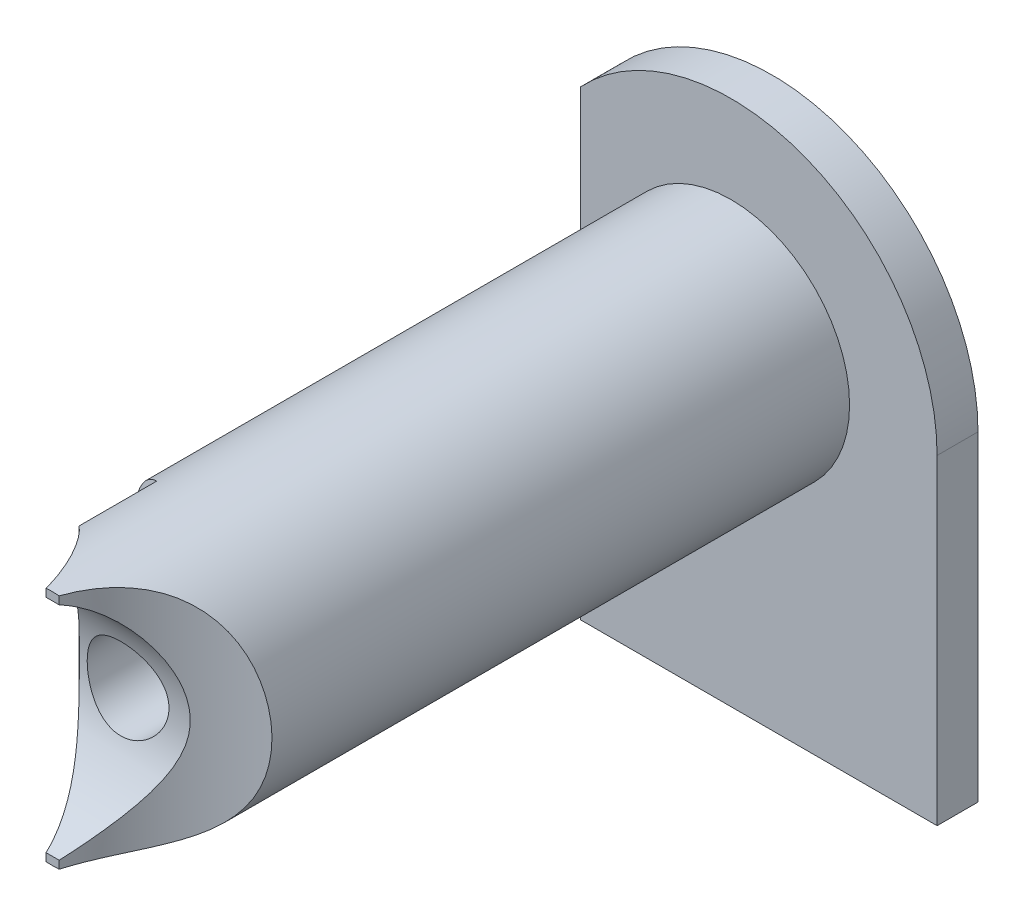
ISO-10303-21;
HEADER;
FILE_DESCRIPTION(('STEP AP214'),'2;1');
FILE_NAME('part.step','',(''),(''),'','','');
FILE_SCHEMA(('AUTOMOTIVE_DESIGN { 1 0 10303 214 1 1 1 1 }'));
ENDSEC;
DATA;
#1=APPLICATION_CONTEXT('core data for automotive mechanical design processes');
#2=APPLICATION_PROTOCOL_DEFINITION('international standard','automotive_design',2000,#1);
#3=PRODUCT_CONTEXT('',#1,'mechanical');
#4=PRODUCT('Part','Part','',(#3));
#5=PRODUCT_RELATED_PRODUCT_CATEGORY('part','',(#4));
#6=PRODUCT_DEFINITION_FORMATION('','',#4);
#7=PRODUCT_DEFINITION_CONTEXT('part definition',#1,'design');
#8=PRODUCT_DEFINITION('design','',#6,#7);
#9=PRODUCT_DEFINITION_SHAPE('','',#8);
#10=(LENGTH_UNIT() NAMED_UNIT(*) SI_UNIT(.MILLI.,.METRE.));
#11=(NAMED_UNIT(*) PLANE_ANGLE_UNIT() SI_UNIT($,.RADIAN.));
#12=(NAMED_UNIT(*) SI_UNIT($,.STERADIAN.) SOLID_ANGLE_UNIT());
#13=UNCERTAINTY_MEASURE_WITH_UNIT(LENGTH_MEASURE(1.E-05),#10,'distance_accuracy_value','');
#14=(GEOMETRIC_REPRESENTATION_CONTEXT(3) GLOBAL_UNCERTAINTY_ASSIGNED_CONTEXT((#13)) GLOBAL_UNIT_ASSIGNED_CONTEXT((#10,
#11,#12)) REPRESENTATION_CONTEXT('',''));
#15=CARTESIAN_POINT('',(0.,0.,0.));
#16=DIRECTION('',(0.,0.,1.));
#17=DIRECTION('',(1.,0.,0.));
#18=AXIS2_PLACEMENT_3D('',#15,#16,#17);
#19=CARTESIAN_POINT('',(0.,0.,0.));
#20=DIRECTION('',(0.,0.,1.));
#21=DIRECTION('',(1.,0.,0.));
#22=AXIS2_PLACEMENT_3D('',#19,#20,#21);
#23=CYLINDRICAL_SURFACE('',#22,2.2);
#24=CARTESIAN_POINT('',(0.,0.,1.39999999998963));
#25=DIRECTION('',(0.,0.,-1.));
#26=DIRECTION('',(1.,0.,0.));
#27=AXIS2_PLACEMENT_3D('',#24,#25,#26);
#28=CIRCLE('',#27,2.20000000001619);
#29=CARTESIAN_POINT('',(2.20000000001619,0.,1.39999999998963));
#30=VERTEX_POINT('',#29);
#31=EDGE_CURVE('E156',#30,#30,#28,.T.);
#32=ORIENTED_EDGE('',*,*,#31,.T.);
#33=EDGE_LOOP('',(#32));
#34=FACE_BOUND('',#33,.T.);
#35=CARTESIAN_POINT('',(0.,0.,16.));
#36=DIRECTION('',(0.,0.,1.));
#37=DIRECTION('',(1.,0.,0.));
#38=AXIS2_PLACEMENT_3D('',#35,#36,#37);
#39=CIRCLE('',#38,2.2);
#40=CARTESIAN_POINT('',(2.2,0.,16.));
#41=VERTEX_POINT('',#40);
#42=EDGE_CURVE('E19',#41,#41,#39,.T.);
#43=ORIENTED_EDGE('',*,*,#42,.T.);
#44=EDGE_LOOP('',(#43));
#45=FACE_BOUND('',#44,.T.);
#46=ADVANCED_FACE('F16',(#34,#45),#23,.F.);
#47=CARTESIAN_POINT('',(0.,0.,16.));
#48=DIRECTION('',(0.,0.,1.));
#49=DIRECTION('',(1.,0.,0.));
#50=AXIS2_PLACEMENT_3D('',#47,#48,#49);
#51=PLANE('',#50);
#52=CARTESIAN_POINT('',(0.,0.,16.));
#53=DIRECTION('',(0.,0.,-1.));
#54=DIRECTION('',(-1.,0.,0.));
#55=AXIS2_PLACEMENT_3D('',#52,#53,#54);
#56=CIRCLE('',#55,1.25);
#57=CARTESIAN_POINT('',(-1.25,0.,16.));
#58=VERTEX_POINT('',#57);
#59=EDGE_CURVE('E159',#58,#58,#56,.F.);
#60=ORIENTED_EDGE('',*,*,#59,.T.);
#61=EDGE_LOOP('',(#60));
#62=FACE_BOUND('',#61,.T.);
#63=ORIENTED_EDGE('',*,*,#42,.F.);
#64=EDGE_LOOP('',(#63));
#65=FACE_BOUND('',#64,.T.);
#66=ADVANCED_FACE('F246',(#62,#65),#51,.F.);
#67=CARTESIAN_POINT('',(0.,0.,0.));
#68=DIRECTION('',(0.,0.,-1.));
#69=DIRECTION('',(-1.,0.,0.));
#70=AXIS2_PLACEMENT_3D('',#67,#68,#69);
#71=CONICAL_SURFACE('',#70,3.60000000000582,0.785398163397448);
#72=CARTESIAN_POINT('',(0.,0.,0.));
#73=DIRECTION('',(0.,0.,-1.));
#74=DIRECTION('',(-1.,0.,0.));
#75=AXIS2_PLACEMENT_3D('',#72,#73,#74);
#76=CIRCLE('',#75,3.60000000000582);
#77=CARTESIAN_POINT('',(-3.60000000000582,0.,0.));
#78=VERTEX_POINT('',#77);
#79=EDGE_CURVE('E141',#78,#78,#76,.T.);
#80=ORIENTED_EDGE('',*,*,#79,.T.);
#81=EDGE_LOOP('',(#80));
#82=FACE_BOUND('',#81,.T.);
#83=ORIENTED_EDGE('',*,*,#31,.F.);
#84=EDGE_LOOP('',(#83));
#85=FACE_BOUND('',#84,.T.);
#86=ADVANCED_FACE('F243',(#82,#85),#71,.F.);
#87=CARTESIAN_POINT('',(0.,0.,22.));
#88=DIRECTION('',(0.,0.,-1.));
#89=DIRECTION('',(-1.,0.,0.));
#90=AXIS2_PLACEMENT_3D('',#87,#88,#89);
#91=CYLINDRICAL_SURFACE('',#90,1.25);
#92=ORIENTED_EDGE('',*,*,#59,.F.);
#93=EDGE_LOOP('',(#92));
#94=FACE_BOUND('',#93,.T.);
#95=CARTESIAN_POINT('',(0.,1.25,19.8978436713564));
#96=CARTESIAN_POINT('',(-0.0679244800988479,1.25000086796655,19.8978443860581));
#97=CARTESIAN_POINT('',(-0.135842933793422,1.24444487050265,19.8957833530326));
#98=CARTESIAN_POINT('',(-0.269657575517761,1.22244980443124,19.8878088146394));
#99=CARTESIAN_POINT('',(-0.335553550477822,1.20600959325332,19.881894904817));
#100=CARTESIAN_POINT('',(-0.463360945324166,1.16290062835713,19.8669627047752));
#101=CARTESIAN_POINT('',(-0.525280337329512,1.13625313605356,19.8579508713991));
#102=CARTESIAN_POINT('',(-0.643791152118634,1.07355949262704,19.837847899369));
#103=CARTESIAN_POINT('',(-0.700381263501824,1.03751103634852,19.8267562509232));
#104=CARTESIAN_POINT('',(-0.809007347203373,0.955414579593332,19.8032203151329));
#105=CARTESIAN_POINT('',(-0.860786737513333,0.909037171034703,19.7907405403483));
#106=CARTESIAN_POINT('',(-0.956009639956803,0.808301154152748,19.766133329688));
#107=CARTESIAN_POINT('',(-0.999451698829062,0.753941157312231,19.7540059555505));
#108=CARTESIAN_POINT('',(-1.07795080960379,0.636886846726681,19.7310560526318));
#109=CARTESIAN_POINT('',(-1.11273621101807,0.574000420441734,19.7202800833318));
#110=CARTESIAN_POINT('',(-1.17113157115788,0.442831894091509,19.701667612356));
#111=CARTESIAN_POINT('',(-1.19474477999888,0.374551369983123,19.6938302559428));
#112=CARTESIAN_POINT('',(-1.2292470985948,0.237225190263073,19.6822295733358));
#113=CARTESIAN_POINT('',(-1.24057636261075,0.16830221771519,19.678325699712));
#114=CARTESIAN_POINT('',(-1.25159174102537,0.0294302907076386,19.6745314082797));
#115=CARTESIAN_POINT('',(-1.25128107389356,-0.0405183747982762,19.6746398810475));
#116=CARTESIAN_POINT('',(-1.23929822635911,-0.176329706572923,19.6787644389511));
#117=CARTESIAN_POINT('',(-1.22810474950267,-0.242240442098288,19.6826158787156));
#118=CARTESIAN_POINT('',(-1.19546944676986,-0.371182833738493,19.6935843230476));
#119=CARTESIAN_POINT('',(-1.17402691447761,-0.434214291071031,19.7007015527082));
#120=CARTESIAN_POINT('',(-1.12123918718876,-0.556620898055839,19.7176047832685));
#121=CARTESIAN_POINT('',(-1.08976314845211,-0.61593458665218,19.7274257985207));
#122=CARTESIAN_POINT('',(-1.01791174395466,-0.728575193755699,19.7487221659081));
#123=CARTESIAN_POINT('',(-0.977533779711246,-0.781900357331002,19.760198000748));
#124=CARTESIAN_POINT('',(-0.886641267506775,-0.883891513879295,19.7842833845292));
#125=CARTESIAN_POINT('',(-0.8357188282652,-0.932187934326669,19.7969209237661));
#126=CARTESIAN_POINT('',(-0.726397770707999,-1.01968084494647,19.8214254442492));
#127=CARTESIAN_POINT('',(-0.66799781853852,-1.05887570804644,19.8332922874464));
#128=CARTESIAN_POINT('',(-0.544129319151011,-1.12761669610327,19.8550717885169));
#129=CARTESIAN_POINT('',(-0.478561028872439,-1.15699504567843,19.8649494215703));
#130=CARTESIAN_POINT('',(-0.342979508718129,-1.20416381175255,19.8812278361306));
#131=CARTESIAN_POINT('',(-0.272968324636218,-1.22195951975829,19.8876302050829));
#132=CARTESIAN_POINT('',(-0.134090244649073,-1.24468095728118,19.8958697798906));
#133=CARTESIAN_POINT('',(-0.065329920620134,-1.25018382842495,19.897911498419));
#134=CARTESIAN_POINT('',(0.0721472888909036,-1.24980687642328,19.8977724226291));
#135=CARTESIAN_POINT('',(0.140864180299875,-1.24392932217262,19.8955924699776));
#136=CARTESIAN_POINT('',(0.273588572060938,-1.22147843143933,19.8874606833778));
#137=CARTESIAN_POINT('',(0.337675880725648,-1.20531827758905,19.8816547123743));
#138=CARTESIAN_POINT('',(0.462212228709352,-1.16326336828004,19.8670890804522));
#139=CARTESIAN_POINT('',(0.522660591188891,-1.13736680831216,19.8583288720372));
#140=CARTESIAN_POINT('',(0.640446216933245,-1.07559215860392,19.838479568612));
#141=CARTESIAN_POINT('',(0.69761176173089,-1.03940914354079,19.8273223701759));
#142=CARTESIAN_POINT('',(0.80526753647923,-0.958428141299509,19.8040632405038));
#143=CARTESIAN_POINT('',(0.855755651824465,-0.913627436046384,19.7919610119165));
#144=CARTESIAN_POINT('',(0.951354636496911,-0.813903923966883,19.7674102209685));
#145=CARTESIAN_POINT('',(0.996046346298425,-0.758574360910484,19.7549766337844));
#146=CARTESIAN_POINT('',(1.07554433194323,-0.640894131740424,19.7317831377029));
#147=CARTESIAN_POINT('',(1.11035087446422,-0.578543655097271,19.7210231836585));
#148=CARTESIAN_POINT('',(1.16878954928363,-0.448840953661153,19.7024299594336));
#149=CARTESIAN_POINT('',(1.19248711414304,-0.381520791166974,19.6945796103623));
#150=CARTESIAN_POINT('',(1.22811609579468,-0.243523290194956,19.6826186057761));
#151=CARTESIAN_POINT('',(1.24005211170052,-0.172847275295524,19.6785064885507));
#152=CARTESIAN_POINT('',(1.25138151325684,-0.0339646408415084,19.6746036325415));
#153=CARTESIAN_POINT('',(1.25137467368776,0.0341877486817581,19.674606249536));
#154=CARTESIAN_POINT('',(1.24031579157669,0.169475270760439,19.6784153912838));
#155=CARTESIAN_POINT('',(1.22926475952144,0.236610495810688,19.6822215680309));
#156=CARTESIAN_POINT('',(1.19683703997043,0.366739710113705,19.6931287184379));
#157=CARTESIAN_POINT('',(1.17565097385536,0.429786678559307,19.7001687752202));
#158=CARTESIAN_POINT('',(1.12373438064327,0.551450801547351,19.7168175975318));
#159=CARTESIAN_POINT('',(1.09300209006457,0.610067135125508,19.7264268376227));
#160=CARTESIAN_POINT('',(1.02150459005946,0.72367495976101,19.7476932825457));
#161=CARTESIAN_POINT('',(0.980398025175527,0.7784393292172,19.7594152000636));
#162=CARTESIAN_POINT('',(0.889887080709123,0.880486113485907,19.7834460652259));
#163=CARTESIAN_POINT('',(0.840479956379136,0.92776604334017,19.7957552060804));
#164=CARTESIAN_POINT('',(0.732239723477382,1.01557160693506,19.8202070041386));
#165=CARTESIAN_POINT('',(0.673093154621859,1.05572043580642,19.8323198618095));
#166=CARTESIAN_POINT('',(0.548510903251562,1.1254910455994,19.8543727114239));
#167=CARTESIAN_POINT('',(0.483076273882375,1.15511458544152,19.8643130663155));
#168=CARTESIAN_POINT('',(0.349091955921276,1.20232010017759,19.8805798993618));
#169=CARTESIAN_POINT('',(0.280634096711385,1.22013735783424,19.8869765451443));
#170=CARTESIAN_POINT('',(0.141448006087147,1.24397438925929,19.8956071887561));
#171=CARTESIAN_POINT('',(0.0707207366450371,1.24999909630175,19.8978429272324));
#172=CARTESIAN_POINT('',(0.,1.25,19.8978436713564));
#173=B_SPLINE_CURVE_WITH_KNOTS('',3,(#95,#96,#97,#98,#99,#100,#101,#102,#103,#104,#105,#106,
#107,#108,#109,#110,#111,#112,#113,#114,#115,#116,#117,#118,#119,#120,#121,#122,#123,#124,#125,
#126,#127,#128,#129,#130,#131,#132,#133,#134,#135,#136,#137,#138,#139,#140,#141,#142,#143,#144,
#145,#146,#147,#148,#149,#150,#151,#152,#153,#154,#155,#156,#157,#158,#159,#160,#161,#162,#163,
#164,#165,#166,#167,#168,#169,#170,#171,#172),.UNSPECIFIED.,.T.,.F.,(4,2,2,2,2,2,2,2,2,2,2,2,2,
2,2,2,2,2,2,2,2,2,2,2,2,2,2,2,2,2,2,2,2,2,2,2,2,2,4),(0.,0.203511139491736,0.407043645954993,
0.610154486559866,0.813315177694251,1.02423741599598,1.23519638634716,1.45211698254992,
1.66897443527126,1.87777478156237,2.08651739447182,2.28647500077357,2.48644639113581,
2.68914025789089,2.89189336974925,3.1048510057456,3.31784668261728,3.53431589010938,
3.75068613453101,3.95666316344897,4.16259913132811,4.36074177300059,4.55892115580724,
4.7637300924964,4.96860373347955,5.18418899640245,5.3997684428082,5.61406164396909,
5.8282710168564,6.03172303865505,6.23515644734529,6.43490568970265,6.63469185386391,
6.84218649561138,7.04974988518443,7.26621834146235,7.4826506058514,7.69462841418539,
7.90651752514187),.UNSPECIFIED.);
#174=CARTESIAN_POINT('',(0.,1.25,19.8978436713564));
#175=VERTEX_POINT('',#174);
#176=EDGE_CURVE('E140',#175,#175,#173,.T.);
#177=ORIENTED_EDGE('',*,*,#176,.T.);
#178=EDGE_LOOP('',(#177));
#179=FACE_BOUND('',#178,.T.);
#180=ADVANCED_FACE('F239',(#94,#179),#91,.F.);
#181=CARTESIAN_POINT('',(0.,0.,0.));
#182=DIRECTION('',(0.,0.,1.));
#183=DIRECTION('',(1.,0.,0.));
#184=AXIS2_PLACEMENT_3D('',#181,#182,#183);
#185=PLANE('',#184);
#186=ORIENTED_EDGE('',*,*,#79,.F.);
#187=EDGE_LOOP('',(#186));
#188=FACE_BOUND('',#187,.T.);
#189=DIRECTION('',(0.,1.,0.));
#190=VECTOR('',#189,1.);
#191=CARTESIAN_POINT('',(6.3,-9.8,0.));
#192=LINE('',#191,#190);
#193=CARTESIAN_POINT('',(6.3,-9.8,0.));
#194=VERTEX_POINT('',#193);
#195=CARTESIAN_POINT('',(6.3,0.,0.));
#196=VERTEX_POINT('',#195);
#197=EDGE_CURVE('E90',#194,#196,#192,.T.);
#198=ORIENTED_EDGE('',*,*,#197,.F.);
#199=DIRECTION('',(1.,0.,0.));
#200=VECTOR('',#199,1.);
#201=CARTESIAN_POINT('',(-4.6,-9.8,0.));
#202=LINE('',#201,#200);
#203=CARTESIAN_POINT('',(-4.6,-9.8,0.));
#204=VERTEX_POINT('',#203);
#205=EDGE_CURVE('E106',#204,#194,#202,.T.);
#206=ORIENTED_EDGE('',*,*,#205,.F.);
#207=DIRECTION('',(0.,-1.,0.));
#208=VECTOR('',#207,1.);
#209=CARTESIAN_POINT('',(-4.6,4.30464865000618,0.));
#210=LINE('',#209,#208);
#211=CARTESIAN_POINT('',(-4.6,4.30464865000618,0.));
#212=VERTEX_POINT('',#211);
#213=EDGE_CURVE('E137',#212,#204,#210,.T.);
#214=ORIENTED_EDGE('',*,*,#213,.F.);
#215=CARTESIAN_POINT('',(0.,0.,0.));
#216=DIRECTION('',(0.,0.,1.));
#217=DIRECTION('',(1.,0.,0.));
#218=AXIS2_PLACEMENT_3D('',#215,#216,#217);
#219=CIRCLE('',#218,6.3);
#220=EDGE_CURVE('E86',#196,#212,#219,.T.);
#221=ORIENTED_EDGE('',*,*,#220,.F.);
#222=EDGE_LOOP('',(#198,#206,#214,#221));
#223=FACE_BOUND('',#222,.T.);
#224=ADVANCED_FACE('F229',(#188,#223),#185,.F.);
#225=CARTESIAN_POINT('',(0.,0.,23.2935034352874));
#226=DIRECTION('',(1.,0.,0.));
#227=DIRECTION('',(0.,0.,-1.));
#228=AXIS2_PLACEMENT_3D('',#225,#226,#227);
#229=CYLINDRICAL_SURFACE('',#228,3.61842579478704);
#230=ORIENTED_EDGE('',*,*,#176,.F.);
#231=EDGE_LOOP('',(#230));
#232=FACE_BOUND('',#231,.T.);
#233=DIRECTION('',(1.,0.,0.));
#234=VECTOR('',#233,1.);
#235=CARTESIAN_POINT('',(0.,3.37932746197818,22.));
#236=LINE('',#235,#234);
#237=CARTESIAN_POINT('',(-0.184638075837882,3.37932746197818,22.));
#238=VERTEX_POINT('',#237);
#239=CARTESIAN_POINT('',(0.218219539958672,3.37932746197818,22.));
#240=VERTEX_POINT('',#239);
#241=EDGE_CURVE('E142',#238,#240,#236,.T.);
#242=ORIENTED_EDGE('',*,*,#241,.F.);
#243=CARTESIAN_POINT('',(-0.184638075837882,3.37932746197818,22.));
#244=CARTESIAN_POINT('',(-0.211156231165822,3.34149870850248,21.9011564537886));
#245=CARTESIAN_POINT('',(-0.240102435210036,3.29956334294519,21.804599611213));
#246=CARTESIAN_POINT('',(-0.302028706600854,3.2081121569774,21.6166244880252));
#247=CARTESIAN_POINT('',(-0.335004563774821,3.15860423496916,21.5252009874701));
#248=CARTESIAN_POINT('',(-0.404101696405193,3.05275051746999,21.3481697718626));
#249=CARTESIAN_POINT('',(-0.440211237197433,2.99642994547444,21.2625423295464));
#250=CARTESIAN_POINT('',(-0.514855657187254,2.877318330208,21.0970419071478));
#251=CARTESIAN_POINT('',(-0.553391169868868,2.81452559413697,21.0171704418753));
#252=CARTESIAN_POINT('',(-0.671071326812881,2.61764283811563,20.7871974398669));
#253=CARTESIAN_POINT('',(-0.752632892515098,2.47453761652903,20.6458931668224));
#254=CARTESIAN_POINT('',(-0.91514122800787,2.16661334121827,20.3884801926924));
#255=CARTESIAN_POINT('',(-0.996087029222736,2.00176549151058,20.2724054551357));
#256=CARTESIAN_POINT('',(-1.13854217466289,1.67541983500405,20.0815381400047));
#257=CARTESIAN_POINT('',(-1.2012012753984,1.51645563765253,20.0032924300049));
#258=CARTESIAN_POINT('',(-1.31272831562854,1.18472090812666,19.8698730102282));
#259=CARTESIAN_POINT('',(-1.36162706865452,1.0119823531467,19.8146476153272));
#260=CARTESIAN_POINT('',(-1.43108421837339,0.688496535683084,19.7380477448507));
#261=CARTESIAN_POINT('',(-1.45520583678599,0.539567696935899,19.7123090323962));
#262=CARTESIAN_POINT('',(-1.48590572805914,0.237910065879286,19.6797308912269));
#263=CARTESIAN_POINT('',(-1.49250140019073,0.0851851943634162,19.6728727181946));
#264=CARTESIAN_POINT('',(-1.48711347849168,-0.219638538059778,19.6785316728409));
#265=CARTESIAN_POINT('',(-1.47511992170577,-0.371737019438807,19.6910591903351));
#266=CARTESIAN_POINT('',(-1.43442357218647,-0.67100977546266,19.7346139908888));
#267=CARTESIAN_POINT('',(-1.4056997864648,-0.81817761737474,19.7656645176927));
#268=CARTESIAN_POINT('',(-1.32503908738958,-1.14628720981243,19.8560875352559));
#269=CARTESIAN_POINT('',(-1.26877988168136,-1.32459779253885,19.9210717458046));
#270=CARTESIAN_POINT('',(-1.14340801119706,-1.66541071910351,20.075649049543));
#271=CARTESIAN_POINT('',(-1.07426888421057,-1.82787944915997,20.1652929910027));
#272=CARTESIAN_POINT('',(-0.929036379858701,-2.13918185944321,20.3690728991352));
#273=CARTESIAN_POINT('',(-0.852820661460019,-2.28762171998165,20.4837192110942));
#274=CARTESIAN_POINT('',(-0.701382057343645,-2.5651243495847,20.7345935165106));
#275=CARTESIAN_POINT('',(-0.626157563676736,-2.69422331116887,20.8707801939833));
#276=CARTESIAN_POINT('',(-0.518621597069257,-2.87119991529148,21.0894426414053));
#277=CARTESIAN_POINT('',(-0.483831102446247,-2.92715907171335,21.1642913146299));
#278=CARTESIAN_POINT('',(-0.416464846072824,-3.03352434479586,21.3187815726451));
#279=CARTESIAN_POINT('',(-0.383888590896951,-3.08393170019425,21.3984220821068));
#280=CARTESIAN_POINT('',(-0.321456204380259,-3.17898141683488,21.5625759173482));
#281=CARTESIAN_POINT('',(-0.291611547947464,-3.2235997601302,21.6471075640776));
#282=CARTESIAN_POINT('',(-0.235373748885312,-3.30641251909317,21.82045054339));
#283=CARTESIAN_POINT('',(-0.208983543288508,-3.34460147618006,21.9092654309972));
#284=CARTESIAN_POINT('',(-0.184638075837881,-3.37932746197819,22.));
#285=B_SPLINE_CURVE_WITH_KNOTS('',3,(#243,#244,#245,#246,#247,#248,#249,#250,#251,#252,#253,
#254,#255,#256,#257,#258,#259,#260,#261,#262,#263,#264,#265,#266,#267,#268,#269,#270,#271,#272,
#273,#274,#275,#276,#277,#278,#279,#280,#281,#282,#283,#284),.UNSPECIFIED.,.F.,.F.,(4,2,2,2,2,2,
2,2,2,2,2,2,2,2,2,2,2,2,2,2,4),(0.,0.327108060363067,0.653877234984881,0.979471606352299,
1.3051513543538,1.95341331613028,2.60254262412977,3.16433156329025,3.72485229241627,
4.182013982662,4.63872164565754,5.09567416720481,5.55320130900164,6.14384287358508,
6.73571158795343,7.34103221298297,7.94520556295312,8.24412659479571,8.54298079460886,
8.84303774768608,9.14334817979042),.UNSPECIFIED.);
#286=CARTESIAN_POINT('',(-0.184638075837881,-3.37932746197818,22.));
#287=VERTEX_POINT('',#286);
#288=EDGE_CURVE('E145',#238,#287,#285,.T.);
#289=ORIENTED_EDGE('',*,*,#288,.T.);
#290=DIRECTION('',(1.,0.,0.));
#291=VECTOR('',#290,1.);
#292=CARTESIAN_POINT('',(0.,-3.37932746197818,22.));
#293=LINE('',#292,#291);
#294=CARTESIAN_POINT('',(0.218219539958672,-3.37932746197818,22.));
#295=VERTEX_POINT('',#294);
#296=EDGE_CURVE('E138',#295,#287,#293,.F.);
#297=ORIENTED_EDGE('',*,*,#296,.F.);
#298=CARTESIAN_POINT('',(0.218219539958672,-3.37932746197818,22.));
#299=CARTESIAN_POINT('',(0.249955595366505,-3.34129490718428,21.9006260992964));
#300=CARTESIAN_POINT('',(0.284622608844999,-3.29921371335805,21.8038249336452));
#301=CARTESIAN_POINT('',(0.358874569765495,-3.20773227207749,21.6158999905739));
#302=CARTESIAN_POINT('',(0.398452521957451,-3.15834241634905,21.5247684090622));
#303=CARTESIAN_POINT('',(0.481412109280792,-3.05324603464561,21.3489932261304));
#304=CARTESIAN_POINT('',(0.524767948097167,-2.99758168690944,21.2643120424699));
#305=CARTESIAN_POINT('',(0.614630027769926,-2.88026548643591,21.1009731962136));
#306=CARTESIAN_POINT('',(0.661137389969564,-2.81861149910588,21.0223176990502));
#307=CARTESIAN_POINT('',(0.803537182970882,-2.62617949665099,20.7964695843413));
#308=CARTESIAN_POINT('',(0.902861324595828,-2.4872440652626,20.6582654552818));
#309=CARTESIAN_POINT('',(1.10382943480736,-2.18967908156275,20.4062047350761));
#310=CARTESIAN_POINT('',(1.20547857075844,-2.03100128134004,20.2924097196792));
#311=CARTESIAN_POINT('',(1.38744824926844,-1.71969183503718,20.1054786092747));
#312=CARTESIAN_POINT('',(1.46868125810829,-1.56972223376261,20.0288042654267));
#313=CARTESIAN_POINT('',(1.61859507468528,-1.25534052987597,19.8955423392714));
#314=CARTESIAN_POINT('',(1.68730843145521,-1.09096757227611,19.8389022990206));
#315=CARTESIAN_POINT('',(1.78407116856308,-0.799205821324052,19.7622552275132));
#316=CARTESIAN_POINT('',(1.81813629235307,-0.675412440235208,19.7363604986931));
#317=CARTESIAN_POINT('',(1.8699638889713,-0.422557817866898,19.69757133253));
#318=CARTESIAN_POINT('',(1.88776080128269,-0.293508311929657,19.6846494262472));
#319=CARTESIAN_POINT('',(1.9039713158961,-0.0327035544222784,19.6728618199396));
#320=CARTESIAN_POINT('',(1.90226877130446,0.0990632387624701,19.6740803467978));
#321=CARTESIAN_POINT('',(1.87953775332483,0.360062829307596,19.6906537282976));
#322=CARTESIAN_POINT('',(1.85848336601226,0.489291991489006,19.7060275382334));
#323=CARTESIAN_POINT('',(1.79340159777166,0.773832864086648,19.7551384332685));
#324=CARTESIAN_POINT('',(1.74490124501591,0.927444496541583,19.7925446470255));
#325=CARTESIAN_POINT('',(1.63224816655548,1.22347710666229,19.8846461611147));
#326=CARTESIAN_POINT('',(1.56804631713182,1.3658610718166,19.9393958842611));
#327=CARTESIAN_POINT('',(1.44859049514985,1.60457570668872,20.0483690565294));
#328=CARTESIAN_POINT('',(1.39519091495397,1.70343437789258,20.0992111252219));
#329=CARTESIAN_POINT('',(1.28581693924228,1.89508020958081,20.209044778376));
#330=CARTESIAN_POINT('',(1.22984131203267,1.98786441320282,20.2680402888479));
#331=CARTESIAN_POINT('',(1.11706053040588,2.16741089926434,20.3939595772521));
#332=CARTESIAN_POINT('',(1.06025509651569,2.25417109349274,20.4608860829024));
#333=CARTESIAN_POINT('',(0.947277450181522,2.42150527115037,20.6025285263854));
#334=CARTESIAN_POINT('',(0.891105375481016,2.50207793023455,20.6772461237552));
#335=CARTESIAN_POINT('',(0.738883420718191,2.71528114483798,20.8939750580893));
#336=CARTESIAN_POINT('',(0.644761687038023,2.84126157853707,21.0441856505552));
#337=CARTESIAN_POINT('',(0.513224865558886,3.01244722593785,21.2865363692757));
#338=CARTESIAN_POINT('',(0.471037092150247,3.06648426251062,21.3700355919397));
#339=CARTESIAN_POINT('',(0.390589747786621,3.16818347863871,21.5426088703919));
#340=CARTESIAN_POINT('',(0.352327503413965,3.21585000351376,21.6316790647196));
#341=CARTESIAN_POINT('',(0.298874623312115,3.28162373663356,21.7682373781404));
#342=CARTESIAN_POINT('',(0.281872812231806,3.30240414888444,21.8137549004021));
#343=CARTESIAN_POINT('',(0.249100289691648,3.34220484205815,21.9059898113939));
#344=CARTESIAN_POINT('',(0.233329651090148,3.36122501882607,21.9527072709168));
#345=CARTESIAN_POINT('',(0.218219539958636,3.37932746197831,21.9999999999999));
#346=B_SPLINE_CURVE_WITH_KNOTS('',3,(#298,#299,#300,#301,#302,#303,#304,#305,#306,#307,#308,
#309,#310,#311,#312,#313,#314,#315,#316,#317,#318,#319,#320,#321,#322,#323,#324,#325,#326,#327,
#328,#329,#330,#331,#332,#333,#334,#335,#336,#337,#338,#339,#340,#341,#342,#343,#344,#345),
.UNSPECIFIED.,.F.,.F.,(4,2,2,2,2,2,2,2,2,2,2,2,2,2,2,2,2,2,2,2,2,2,2,4),(0.,0.332850360488146,
0.665231930102698,0.995499245862366,1.32588469737193,1.98240202844311,2.64055653949701,
3.20000818888788,3.75798392959356,4.14950264865803,4.54019059773311,4.93320685141966,
5.32675015852905,5.82013096474709,6.31507556536427,6.6846162396128,7.0543354775105,
7.42418224452947,7.79410795210199,8.44346251961739,8.76727141479949,9.09085830055256,
9.24934826830561,9.4078476080825),.UNSPECIFIED.);
#347=EDGE_CURVE('E218',#295,#240,#346,.T.);
#348=ORIENTED_EDGE('',*,*,#347,.T.);
#349=EDGE_LOOP('',(#242,#289,#297,#348));
#350=FACE_BOUND('',#349,.T.);
#351=ADVANCED_FACE('F223',(#232,#350),#229,.F.);
#352=CARTESIAN_POINT('',(0.,0.,0.));
#353=DIRECTION('',(0.,0.,1.));
#354=DIRECTION('',(1.,0.,0.));
#355=AXIS2_PLACEMENT_3D('',#352,#353,#354);
#356=CYLINDRICAL_SURFACE('',#355,6.3);
#357=CARTESIAN_POINT('',(0.,0.,1.25));
#358=DIRECTION('',(0.,0.,1.));
#359=DIRECTION('',(1.,0.,0.));
#360=AXIS2_PLACEMENT_3D('',#357,#358,#359);
#361=CIRCLE('',#360,6.3);
#362=CARTESIAN_POINT('',(6.3,0.,1.25));
#363=VERTEX_POINT('',#362);
#364=CARTESIAN_POINT('',(-4.6,4.30464865000618,1.25));
#365=VERTEX_POINT('',#364);
#366=EDGE_CURVE('E123',#363,#365,#361,.T.);
#367=ORIENTED_EDGE('',*,*,#366,.F.);
#368=DIRECTION('',(0.,0.,1.));
#369=VECTOR('',#368,1.);
#370=CARTESIAN_POINT('',(6.3,0.,0.));
#371=LINE('',#370,#369);
#372=EDGE_CURVE('E109',#196,#363,#371,.T.);
#373=ORIENTED_EDGE('',*,*,#372,.F.);
#374=ORIENTED_EDGE('',*,*,#220,.T.);
#375=DIRECTION('',(0.,0.,1.));
#376=VECTOR('',#375,1.);
#377=CARTESIAN_POINT('',(-4.6,4.30464865000618,0.));
#378=LINE('',#377,#376);
#379=EDGE_CURVE('E134',#365,#212,#378,.F.);
#380=ORIENTED_EDGE('',*,*,#379,.F.);
#381=EDGE_LOOP('',(#367,#373,#374,#380));
#382=FACE_BOUND('',#381,.T.);
#383=ADVANCED_FACE('F228',(#382),#356,.T.);
#384=CARTESIAN_POINT('',(-4.6,4.30464865000618,0.));
#385=DIRECTION('',(-1.,0.,0.));
#386=DIRECTION('',(0.,-1.,0.));
#387=AXIS2_PLACEMENT_3D('',#384,#385,#386);
#388=PLANE('',#387);
#389=DIRECTION('',(0.,1.,0.));
#390=VECTOR('',#389,1.);
#391=CARTESIAN_POINT('',(-4.6,-3.08264576191558,1.25));
#392=LINE('',#391,#390);
#393=CARTESIAN_POINT('',(-4.6,-9.8,1.25));
#394=VERTEX_POINT('',#393);
#395=EDGE_CURVE('E121',#365,#394,#392,.F.);
#396=ORIENTED_EDGE('',*,*,#395,.F.);
#397=ORIENTED_EDGE('',*,*,#379,.T.);
#398=ORIENTED_EDGE('',*,*,#213,.T.);
#399=DIRECTION('',(0.,0.,1.));
#400=VECTOR('',#399,1.);
#401=CARTESIAN_POINT('',(-4.6,-9.8,0.));
#402=LINE('',#401,#400);
#403=EDGE_CURVE('E130',#394,#204,#402,.F.);
#404=ORIENTED_EDGE('',*,*,#403,.F.);
#405=EDGE_LOOP('',(#396,#397,#398,#404));
#406=FACE_BOUND('',#405,.T.);
#407=ADVANCED_FACE('F282',(#406),#388,.T.);
#408=CARTESIAN_POINT('',(-4.6,-9.8,0.));
#409=DIRECTION('',(0.,-1.,0.));
#410=DIRECTION('',(1.,0.,0.));
#411=AXIS2_PLACEMENT_3D('',#408,#409,#410);
#412=PLANE('',#411);
#413=DIRECTION('',(1.,0.,0.));
#414=VECTOR('',#413,1.);
#415=CARTESIAN_POINT('',(0.574107153339075,-9.8,1.25));
#416=LINE('',#415,#414);
#417=CARTESIAN_POINT('',(6.3,-9.8,1.25));
#418=VERTEX_POINT('',#417);
#419=EDGE_CURVE('E104',#394,#418,#416,.T.);
#420=ORIENTED_EDGE('',*,*,#419,.F.);
#421=ORIENTED_EDGE('',*,*,#403,.T.);
#422=ORIENTED_EDGE('',*,*,#205,.T.);
#423=DIRECTION('',(0.,0.,1.));
#424=VECTOR('',#423,1.);
#425=CARTESIAN_POINT('',(6.3,-9.8,0.));
#426=LINE('',#425,#424);
#427=EDGE_CURVE('E99',#418,#194,#426,.F.);
#428=ORIENTED_EDGE('',*,*,#427,.F.);
#429=EDGE_LOOP('',(#420,#421,#422,#428));
#430=FACE_BOUND('',#429,.T.);
#431=ADVANCED_FACE('F101',(#430),#412,.T.);
#432=CARTESIAN_POINT('',(6.3,-9.8,0.));
#433=DIRECTION('',(1.,0.,0.));
#434=DIRECTION('',(0.,1.,0.));
#435=AXIS2_PLACEMENT_3D('',#432,#433,#434);
#436=PLANE('',#435);
#437=DIRECTION('',(0.,1.,0.));
#438=VECTOR('',#437,1.);
#439=CARTESIAN_POINT('',(6.3,-3.08264576191558,1.25));
#440=LINE('',#439,#438);
#441=EDGE_CURVE('E113',#418,#363,#440,.T.);
#442=ORIENTED_EDGE('',*,*,#441,.F.);
#443=ORIENTED_EDGE('',*,*,#427,.T.);
#444=ORIENTED_EDGE('',*,*,#197,.T.);
#445=ORIENTED_EDGE('',*,*,#372,.T.);
#446=EDGE_LOOP('',(#442,#443,#444,#445));
#447=FACE_BOUND('',#446,.T.);
#448=ADVANCED_FACE('F114',(#447),#436,.T.);
#449=CARTESIAN_POINT('',(-1.8,0.,17.));
#450=DIRECTION('',(0.5,0.,-0.866025403784439));
#451=DIRECTION('',(-0.866025403784439,0.,-0.5));
#452=AXIS2_PLACEMENT_3D('',#449,#450,#451);
#453=PLANE('',#452);
#454=DIRECTION('',(0.,1.,0.));
#455=VECTOR('',#454,1.);
#456=CARTESIAN_POINT('',(-1.8,0.,17.));
#457=LINE('',#456,#455);
#458=CARTESIAN_POINT('',(-1.8,-3.14652586196268,17.));
#459=VERTEX_POINT('',#458);
#460=CARTESIAN_POINT('',(-1.8,3.14652586196268,17.));
#461=VERTEX_POINT('',#460);
#462=EDGE_CURVE('E108',#459,#461,#457,.T.);
#463=ORIENTED_EDGE('',*,*,#462,.T.);
#464=CARTESIAN_POINT('',(0.,0.,18.0392304845413));
#465=DIRECTION('',(0.5,0.,-0.866025403784439));
#466=DIRECTION('',(0.866025403784439,0.,0.5));
#467=AXIS2_PLACEMENT_3D('',#464,#465,#466);
#468=ELLIPSE('',#467,4.18578945162479,3.625);
#469=EDGE_CURVE('E198',#459,#461,#468,.T.);
#470=ORIENTED_EDGE('',*,*,#469,.F.);
#471=EDGE_LOOP('',(#463,#470));
#472=FACE_BOUND('',#471,.T.);
#473=ADVANCED_FACE('F301',(#472),#453,.F.);
#474=CARTESIAN_POINT('',(-1.8,0.,22.));
#475=DIRECTION('',(1.,0.,0.));
#476=DIRECTION('',(0.,0.,-1.));
#477=AXIS2_PLACEMENT_3D('',#474,#475,#476);
#478=PLANE('',#477);
#479=DIRECTION('',(0.,0.,1.));
#480=VECTOR('',#479,1.);
#481=CARTESIAN_POINT('',(-1.8,3.14652586196268,0.));
#482=LINE('',#481,#480);
#483=CARTESIAN_POINT('',(-1.79999999999999,3.14652586196269,19.3750776405004));
#484=VERTEX_POINT('',#483);
#485=EDGE_CURVE('E424',#461,#484,#482,.T.);
#486=ORIENTED_EDGE('',*,*,#485,.F.);
#487=ORIENTED_EDGE('',*,*,#462,.F.);
#488=DIRECTION('',(0.,0.,1.));
#489=VECTOR('',#488,1.);
#490=CARTESIAN_POINT('',(-1.8,-3.14652586196268,0.));
#491=LINE('',#490,#489);
#492=CARTESIAN_POINT('',(-1.8,-3.14652586196268,19.3750776405004));
#493=VERTEX_POINT('',#492);
#494=EDGE_CURVE('E197',#493,#459,#491,.F.);
#495=ORIENTED_EDGE('',*,*,#494,.F.);
#496=DIRECTION('',(0.,1.,0.));
#497=VECTOR('',#496,1.);
#498=CARTESIAN_POINT('',(-1.79999999999999,0.,19.3750776405004));
#499=LINE('',#498,#497);
#500=EDGE_CURVE('E217',#493,#484,#499,.T.);
#501=ORIENTED_EDGE('',*,*,#500,.T.);
#502=EDGE_LOOP('',(#486,#487,#495,#501));
#503=FACE_BOUND('',#502,.T.);
#504=ADVANCED_FACE('F205',(#503),#478,.F.);
#505=CARTESIAN_POINT('',(-5.4,0.,23.4));
#506=DIRECTION('',(0.,1.,0.));
#507=DIRECTION('',(0.,0.,1.));
#508=AXIS2_PLACEMENT_3D('',#505,#506,#507);
#509=CYLINDRICAL_SURFACE('',#508,5.4);
#510=DIRECTION('',(0.,1.,0.));
#511=VECTOR('',#510,1.);
#512=CARTESIAN_POINT('',(-0.184638075837881,0.,22.));
#513=LINE('',#512,#511);
#514=CARTESIAN_POINT('',(-0.184638075837881,3.62029470912948,22.));
#515=VERTEX_POINT('',#514);
#516=EDGE_CURVE('E144',#515,#238,#513,.F.);
#517=ORIENTED_EDGE('',*,*,#516,.F.);
#518=CARTESIAN_POINT('',(-1.79999999999999,3.14652586196269,19.3750776405004));
#519=CARTESIAN_POINT('',(-1.71977721871926,3.19242463934373,19.4467729888297));
#520=CARTESIAN_POINT('',(-1.64036903943807,3.23377401589615,19.5221673969035));
#521=CARTESIAN_POINT('',(-1.48454971683947,3.30819685108098,19.6796006841654));
#522=CARTESIAN_POINT('',(-1.40813441050172,3.34128217650513,19.7616298093544));
#523=CARTESIAN_POINT('',(-1.25990098807927,3.39994080184454,19.931250397919));
#524=CARTESIAN_POINT('',(-1.18805680222206,3.42556038862744,20.0188033076942));
#525=CARTESIAN_POINT('',(-1.04931897795177,3.47057255990351,20.1992922210633));
#526=CARTESIAN_POINT('',(-0.98242688432158,3.48996320755339,20.2922298884256));
#527=CARTESIAN_POINT('',(-0.8546555516464,3.52342600211264,20.4823150131274));
#528=CARTESIAN_POINT('',(-0.793745926306146,3.53752617552029,20.5794371580583));
#529=CARTESIAN_POINT('',(-0.678022567689542,3.56151583691171,20.7777605312194));
#530=CARTESIAN_POINT('',(-0.623211483306292,3.57140350043168,20.8789635061526));
#531=CARTESIAN_POINT('',(-0.468513246336572,3.59612305268534,21.1879067885231));
#532=CARTESIAN_POINT('',(-0.378308769641544,3.60602353140226,21.4010591801451));
#533=CARTESIAN_POINT('',(-0.280230709335227,3.61421678180914,21.6817385059798));
#534=CARTESIAN_POINT('',(-0.259448652463061,3.61575619668838,21.7449543539739));
#535=CARTESIAN_POINT('',(-0.2202692021038,3.61835541177585,21.8720004816896));
#536=CARTESIAN_POINT('',(-0.201867397620007,3.61941610848206,21.9358293823759));
#537=CARTESIAN_POINT('',(-0.184638075837881,3.62029470912948,22.));
#538=B_SPLINE_CURVE_WITH_KNOTS('',3,(#518,#519,#520,#521,#522,#523,#524,#525,#526,#527,#528,
#529,#530,#531,#532,#533,#534,#535,#536,#537),.UNSPECIFIED.,.F.,.F.,(4,2,2,2,2,2,2,2,2,4),(0.,
0.350661379517194,0.700816292854721,1.04875169253755,1.39679517571378,1.74296794119285,
2.0892904841724,2.78165454430928,2.98131823544443,3.18060644789511),.UNSPECIFIED.);
#539=EDGE_CURVE('E185',#484,#515,#538,.T.);
#540=ORIENTED_EDGE('',*,*,#539,.F.);
#541=ORIENTED_EDGE('',*,*,#500,.F.);
#542=CARTESIAN_POINT('',(-0.184638075837882,-3.62029470912948,22.));
#543=CARTESIAN_POINT('',(-0.204983350822555,-3.61925358335016,21.9242092524802));
#544=CARTESIAN_POINT('',(-0.226977254859606,-3.61796378997867,21.8488753488475));
#545=CARTESIAN_POINT('',(-0.274223298941085,-3.61469118632956,21.6992436620036));
#546=CARTESIAN_POINT('',(-0.299475760381463,-3.61270830765899,21.6249459817985));
#547=CARTESIAN_POINT('',(-0.380114758235599,-3.60542149905208,21.4036518139308));
#548=CARTESIAN_POINT('',(-0.440338160992857,-3.59878081838098,21.2584208206065));
#549=CARTESIAN_POINT('',(-0.570751979422838,-3.58036972156668,20.9789842491485));
#550=CARTESIAN_POINT('',(-0.640524799019833,-3.56878499742176,20.8445710124984));
#551=CARTESIAN_POINT('',(-0.790699037878973,-3.53854209137756,20.582717078743));
#552=CARTESIAN_POINT('',(-0.871092795641695,-3.51988899035711,20.4552714483155));
#553=CARTESIAN_POINT('',(-1.01761791880794,-3.4798168050056,20.2430357914268));
#554=CARTESIAN_POINT('',(-1.0814836982068,-3.46061574664352,20.1562531375526));
#555=CARTESIAN_POINT('',(-1.2135103815742,-3.41655679626519,19.9875561876652));
#556=CARTESIAN_POINT('',(-1.28166963676559,-3.39170106629013,19.9056400460178));
#557=CARTESIAN_POINT('',(-1.42330098037786,-3.33478666391136,19.7451988220611));
#558=CARTESIAN_POINT('',(-1.49686391650205,-3.30256147194254,19.6668122145873));
#559=CARTESIAN_POINT('',(-1.64670082041077,-3.2304700446727,19.5161674103917));
#560=CARTESIAN_POINT('',(-1.72297851462402,-3.19059294832857,19.4439181377991));
#561=CARTESIAN_POINT('',(-1.79999999999999,-3.14652586196269,19.3750776405004));
#562=B_SPLINE_CURVE_WITH_KNOTS('',3,(#542,#543,#544,#545,#546,#547,#548,#549,#550,#551,#552,
#553,#554,#555,#556,#557,#558,#559,#560,#561),.UNSPECIFIED.,.F.,.F.,(4,2,2,2,2,2,2,2,2,4),(0.,
0.235401858579509,0.470826952936754,0.942192882603263,1.39722819939926,1.85193704703066,
2.17997757710563,2.50789289235904,2.84411522339552,3.1808183634309),.UNSPECIFIED.);
#563=CARTESIAN_POINT('',(-0.184638075837881,-3.62029470912948,22.));
#564=VERTEX_POINT('',#563);
#565=EDGE_CURVE('E117',#564,#493,#562,.T.);
#566=ORIENTED_EDGE('',*,*,#565,.F.);
#567=DIRECTION('',(0.,1.,0.));
#568=VECTOR('',#567,1.);
#569=CARTESIAN_POINT('',(-0.184638075837881,0.,22.));
#570=LINE('',#569,#568);
#571=EDGE_CURVE('E410',#287,#564,#570,.F.);
#572=ORIENTED_EDGE('',*,*,#571,.F.);
#573=ORIENTED_EDGE('',*,*,#288,.F.);
#574=EDGE_LOOP('',(#517,#540,#541,#566,#572,#573));
#575=FACE_BOUND('',#574,.T.);
#576=ADVANCED_FACE('F200',(#575),#509,.F.);
#577=CARTESIAN_POINT('',(0.,0.,22.));
#578=DIRECTION('',(0.,0.,1.));
#579=DIRECTION('',(1.,0.,0.));
#580=AXIS2_PLACEMENT_3D('',#577,#578,#579);
#581=PLANE('',#580);
#582=CARTESIAN_POINT('',(0.,0.,22.));
#583=DIRECTION('',(0.,0.,1.));
#584=DIRECTION('',(1.,0.,0.));
#585=AXIS2_PLACEMENT_3D('',#582,#583,#584);
#586=CIRCLE('',#585,3.625);
#587=CARTESIAN_POINT('',(0.218219539958671,3.61842579478704,22.));
#588=VERTEX_POINT('',#587);
#589=EDGE_CURVE('E172',#515,#588,#586,.F.);
#590=ORIENTED_EDGE('',*,*,#589,.F.);
#591=ORIENTED_EDGE('',*,*,#516,.T.);
#592=ORIENTED_EDGE('',*,*,#241,.T.);
#593=DIRECTION('',(0.,1.,0.));
#594=VECTOR('',#593,1.);
#595=CARTESIAN_POINT('',(0.218219539958671,0.,22.));
#596=LINE('',#595,#594);
#597=EDGE_CURVE('E407',#240,#588,#596,.T.);
#598=ORIENTED_EDGE('',*,*,#597,.T.);
#599=EDGE_LOOP('',(#590,#591,#592,#598));
#600=FACE_BOUND('',#599,.T.);
#601=ADVANCED_FACE('F204',(#600),#581,.T.);
#602=CARTESIAN_POINT('',(4.6,0.,23.4));
#603=DIRECTION('',(0.,1.,0.));
#604=DIRECTION('',(0.,0.,1.));
#605=AXIS2_PLACEMENT_3D('',#602,#603,#604);
#606=CYLINDRICAL_SURFACE('',#605,4.6);
#607=DIRECTION('',(0.,1.,0.));
#608=VECTOR('',#607,1.);
#609=CARTESIAN_POINT('',(0.218219539958671,0.,22.));
#610=LINE('',#609,#608);
#611=CARTESIAN_POINT('',(0.218219539958671,-3.61842579478704,22.));
#612=VERTEX_POINT('',#611);
#613=EDGE_CURVE('E34',#612,#295,#610,.T.);
#614=ORIENTED_EDGE('',*,*,#613,.F.);
#615=CARTESIAN_POINT('',(0.218219539958671,3.61842579478704,22.));
#616=CARTESIAN_POINT('',(0.253921932489337,3.61624568485412,21.8882086347392));
#617=CARTESIAN_POINT('',(0.293930942162563,3.61332855383558,21.7777891194954));
#618=CARTESIAN_POINT('',(0.382261584654122,3.60506903524106,21.5603174520332));
#619=CARTESIAN_POINT('',(0.430590013447029,3.5997246590009,21.4532681381064));
#620=CARTESIAN_POINT('',(0.535481817338599,3.58562189737931,21.2427792071954));
#621=CARTESIAN_POINT('',(0.592088281238027,3.57684521941974,21.1393622222685));
#622=CARTESIAN_POINT('',(0.712819588473588,3.5547545631105,20.937554011475));
#623=CARTESIAN_POINT('',(0.776941494796075,3.54144235338112,20.8391608437534));
#624=CARTESIAN_POINT('',(0.901260128819358,3.51166071600719,20.6633969000155));
#625=CARTESIAN_POINT('',(0.960455158990197,3.49603195599884,20.5851739985923));
#626=CARTESIAN_POINT('',(1.08312801054962,3.45999189620774,20.433329815249));
#627=CARTESIAN_POINT('',(1.14660500933964,3.4395815131584,20.3597076546972));
#628=CARTESIAN_POINT('',(1.27697973013087,3.39333419365901,20.2177368983382));
#629=CARTESIAN_POINT('',(1.34386762848448,3.36751224143441,20.1493744389007));
#630=CARTESIAN_POINT('',(1.48037213038412,3.30977536549797,20.01815382368));
#631=CARTESIAN_POINT('',(1.54998869992139,3.27786051770569,19.9552955993264));
#632=CARTESIAN_POINT('',(1.69148011581044,3.20715145188321,19.835003506886));
#633=CARTESIAN_POINT('',(1.76336821377863,3.16830620633323,19.7776150817769));
#634=CARTESIAN_POINT('',(1.90770650732564,3.0835503493824,19.6690873408845));
#635=CARTESIAN_POINT('',(1.98015670832778,3.0376396697317,19.6179480854749));
#636=CARTESIAN_POINT('',(2.12436529051996,2.93859653384595,19.5220190202424));
#637=CARTESIAN_POINT('',(2.1961234665108,2.88546200207908,19.4772310428301));
#638=CARTESIAN_POINT('',(2.33762727540595,2.77206433118164,19.3939532912806));
#639=CARTESIAN_POINT('',(2.40737309036462,2.71180183943494,19.3554629459282));
#640=CARTESIAN_POINT('',(2.5357590336438,2.59178742172974,19.2886095802698));
#641=CARTESIAN_POINT('',(2.59475298935761,2.53277628497101,19.2595907121756));
#642=CARTESIAN_POINT('',(2.70943534607864,2.409701444093,19.2059836041323));
#643=CARTESIAN_POINT('',(2.76512263730632,2.34563606028345,19.1813968461104));
#644=CARTESIAN_POINT('',(2.87245814008219,2.21289253768532,19.1363175372921));
#645=CARTESIAN_POINT('',(2.92410763623724,2.14421587898563,19.1158236811045));
#646=CARTESIAN_POINT('',(3.0228191888843,2.00265780346786,19.0785087142437));
#647=CARTESIAN_POINT('',(3.06987946142927,1.92977476891131,19.0616890286875));
#648=CARTESIAN_POINT('',(3.15948596449291,1.77933667384605,19.0311110405209));
#649=CARTESIAN_POINT('',(3.20196512081568,1.70173298256952,19.0173956457138));
#650=CARTESIAN_POINT('',(3.28129967433372,1.54322889664342,18.9928745615827));
#651=CARTESIAN_POINT('',(3.31815306279162,1.46232733745996,18.9820699105212));
#652=CARTESIAN_POINT('',(3.38589877994151,1.29777934352134,18.9629742554142));
#653=CARTESIAN_POINT('',(3.4167910216851,1.21413286875007,18.954683288032));
#654=CARTESIAN_POINT('',(3.47236962782216,1.04462022652277,18.9402607605764));
#655=CARTESIAN_POINT('',(3.49705566860204,0.958753943575327,18.9341293131015));
#656=CARTESIAN_POINT('',(3.54159374783891,0.779048127351706,18.9233561376554));
#657=CARTESIAN_POINT('',(3.56096683256059,0.685081195243556,18.9188542844025));
#658=CARTESIAN_POINT('',(3.59220305475898,0.495876282277335,18.9117261975752));
#659=CARTESIAN_POINT('',(3.60406899883835,0.400638790041195,18.909099263001));
#660=CARTESIAN_POINT('',(3.6202173259986,0.209432599195088,18.9055484631236));
#661=CARTESIAN_POINT('',(3.62449506502896,0.113463488881477,18.9046256407385));
#662=CARTESIAN_POINT('',(3.62542053513718,-0.0784807621807852,18.9044249747784));
#663=CARTESIAN_POINT('',(3.62207076278328,-0.174455890677439,18.90514659296));
#664=CARTESIAN_POINT('',(3.60751966139422,-0.369174122666772,18.9083364940046));
#665=CARTESIAN_POINT('',(3.59604674838699,-0.467896076527943,18.9108652227649));
#666=CARTESIAN_POINT('',(3.56505643055074,-0.663961362296133,18.9179085648042));
#667=CARTESIAN_POINT('',(3.54554191031585,-0.761305175616237,18.9224224660237));
#668=CARTESIAN_POINT('',(3.49862211782569,-0.953994549740079,18.9337320934756));
#669=CARTESIAN_POINT('',(3.47121264110125,-1.04933901668782,18.9405290358657));
#670=CARTESIAN_POINT('',(3.40876884416594,-1.23722057465766,18.9568020332118));
#671=CARTESIAN_POINT('',(3.37373776778773,-1.32975884099526,18.9662769489059));
#672=CARTESIAN_POINT('',(3.29669024509951,-1.51064442651793,18.988313751512));
#673=CARTESIAN_POINT('',(3.25473013984289,-1.59901870420142,19.0008511021913));
#674=CARTESIAN_POINT('',(3.16410658951741,-1.77159474806954,19.0295918470809));
#675=CARTESIAN_POINT('',(3.11544602403462,-1.85579828564516,19.0457936683621));
#676=CARTESIAN_POINT('',(3.01201172819756,-2.01934835630307,19.0824427199251));
#677=CARTESIAN_POINT('',(2.95724037338969,-2.0986967583544,19.1028883031016));
#678=CARTESIAN_POINT('',(2.84230549109533,-2.25190868986712,19.1486082211806));
#679=CARTESIAN_POINT('',(2.7821423597098,-2.32577262151134,19.1738822015243));
#680=CARTESIAN_POINT('',(2.66098007170486,-2.46327202151522,19.2281485679109));
#681=CARTESIAN_POINT('',(2.60023658458909,-2.52725324809585,19.2568361972433));
#682=CARTESIAN_POINT('',(2.47563726443517,-2.64942567466881,19.3193214224946));
#683=CARTESIAN_POINT('',(2.41178163384044,-2.70761725052816,19.3531186863341));
#684=CARTESIAN_POINT('',(2.28194997588947,-2.81790386301765,19.4260618295382));
#685=CARTESIAN_POINT('',(2.21597480834397,-2.87000133295116,19.4652055604962));
#686=CARTESIAN_POINT('',(2.08290612732079,-2.96798827833937,19.5489719448477));
#687=CARTESIAN_POINT('',(2.01581264532884,-3.01387792824249,19.5935944442128));
#688=CARTESIAN_POINT('',(1.88545922180431,-3.09698117859135,19.6855343997414));
#689=CARTESIAN_POINT('',(1.82220376675256,-3.13454456758409,19.7325431946774));
#690=CARTESIAN_POINT('',(1.69642778794209,-3.20436164597464,19.831293969303));
#691=CARTESIAN_POINT('',(1.63390750829356,-3.23661361554035,19.8830374736828));
#692=CARTESIAN_POINT('',(1.51040023682221,-3.29606032425256,19.9910263936102));
#693=CARTESIAN_POINT('',(1.4494129676575,-3.32325598393052,20.0472709870353));
#694=CARTESIAN_POINT('',(1.32961380747347,-3.3729750593938,20.1640187561409));
#695=CARTESIAN_POINT('',(1.27080275121274,-3.3954966972604,20.2245235406485));
#696=CARTESIAN_POINT('',(1.15237189560859,-3.43756551745649,20.3533654378074));
#697=CARTESIAN_POINT('',(1.09293040320923,-3.45683959803404,20.4219556869179));
#698=CARTESIAN_POINT('',(0.977735898285831,-3.49117026585421,20.5631839511675));
#699=CARTESIAN_POINT('',(0.921984316926065,-3.50622522391093,20.6358235169781));
#700=CARTESIAN_POINT('',(0.760932582944199,-3.54596395279665,20.8592908632311));
#701=CARTESIAN_POINT('',(0.661843175605607,-3.5652190212767,21.015658915834));
#702=CARTESIAN_POINT('',(0.500215075829601,-3.59106657495106,21.3085476953577));
#703=CARTESIAN_POINT('',(0.434311997082198,-3.59938223873546,21.443101130317));
#704=CARTESIAN_POINT('',(0.345582467850695,-3.60861098927524,21.6491425081136));
#705=CARTESIAN_POINT('',(0.317725761868986,-3.61114514572821,21.7184238582433));
#706=CARTESIAN_POINT('',(0.265408738408781,-3.61536536456065,21.858281405069));
#707=CARTESIAN_POINT('',(0.240948350363384,-3.6170514445629,21.9288575748274));
#708=CARTESIAN_POINT('',(0.218219539958672,-3.61842579478704,22.));
#709=B_SPLINE_CURVE_WITH_KNOTS('',3,(#615,#616,#617,#618,#619,#620,#621,#622,#623,#624,#625,
#626,#627,#628,#629,#630,#631,#632,#633,#634,#635,#636,#637,#638,#639,#640,#641,#642,#643,#644,
#645,#646,#647,#648,#649,#650,#651,#652,#653,#654,#655,#656,#657,#658,#659,#660,#661,#662,#663,
#664,#665,#666,#667,#668,#669,#670,#671,#672,#673,#674,#675,#676,#677,#678,#679,#680,#681,#682,
#683,#684,#685,#686,#687,#688,#689,#690,#691,#692,#693,#694,#695,#696,#697,#698,#699,#700,#701,
#702,#703,#704,#705,#706,#707,#708),.UNSPECIFIED.,.F.,.F.,(4,2,2,2,2,2,2,2,2,2,2,2,2,2,2,2,2,2,
2,2,2,2,2,2,2,2,2,2,2,2,2,2,2,2,2,2,2,2,2,2,2,2,2,2,2,2,4),(0.,0.352061637476559,
0.704412244074556,1.05866688466216,1.4127835422674,1.71049393160028,2.00814729050047,
2.30498710881198,2.60182322863967,2.90094259821146,3.20006485736268,3.49927324161585,
3.7984544716537,4.06317314616429,4.32798016890113,4.59270259866183,4.85752752591127,
5.12581540225429,5.39419885055213,5.66258621315496,5.93098756753727,6.21880756933327,
6.50651990370786,6.79440825997682,7.08220240077043,7.38010269884761,7.67789623039902,
7.97584864642515,8.2736744979931,8.56918822827342,8.86457535282003,9.15984804423095,
9.45509906151085,9.73304535076324,10.0109735838139,10.2887904618925,10.5665995313055,
10.82821661386,11.0899182419022,11.3515721788437,11.6133254628224,11.891403186171,
12.1695881398814,12.7259927754898,13.1753793551887,13.3994395444449,13.6234950775999),.UNSPECIFIED.);
#710=EDGE_CURVE('E164',#588,#612,#709,.T.);
#711=ORIENTED_EDGE('',*,*,#710,.F.);
#712=ORIENTED_EDGE('',*,*,#597,.F.);
#713=ORIENTED_EDGE('',*,*,#347,.F.);
#714=EDGE_LOOP('',(#614,#711,#712,#713));
#715=FACE_BOUND('',#714,.T.);
#716=ADVANCED_FACE('F174',(#715),#606,.F.);
#717=CARTESIAN_POINT('',(0.,0.,22.));
#718=DIRECTION('',(0.,0.,1.));
#719=DIRECTION('',(1.,0.,0.));
#720=AXIS2_PLACEMENT_3D('',#717,#718,#719);
#721=PLANE('',#720);
#722=CARTESIAN_POINT('',(0.,0.,22.));
#723=DIRECTION('',(0.,0.,1.));
#724=DIRECTION('',(1.,0.,0.));
#725=AXIS2_PLACEMENT_3D('',#722,#723,#724);
#726=CIRCLE('',#725,3.625);
#727=EDGE_CURVE('E25',#612,#564,#726,.F.);
#728=ORIENTED_EDGE('',*,*,#727,.F.);
#729=ORIENTED_EDGE('',*,*,#613,.T.);
#730=ORIENTED_EDGE('',*,*,#296,.T.);
#731=ORIENTED_EDGE('',*,*,#571,.T.);
#732=EDGE_LOOP('',(#728,#729,#730,#731));
#733=FACE_BOUND('',#732,.T.);
#734=ADVANCED_FACE('F330',(#733),#721,.T.);
#735=CARTESIAN_POINT('',(0.574107153339075,-3.08264576191558,1.25));
#736=DIRECTION('',(0.,0.,1.));
#737=DIRECTION('',(1.,0.,0.));
#738=AXIS2_PLACEMENT_3D('',#735,#736,#737);
#739=PLANE('',#738);
#740=CARTESIAN_POINT('',(0.,0.,1.25));
#741=DIRECTION('',(0.,0.,1.));
#742=DIRECTION('',(1.,0.,0.));
#743=AXIS2_PLACEMENT_3D('',#740,#741,#742);
#744=CIRCLE('',#743,3.625);
#745=CARTESIAN_POINT('',(3.625,0.,1.25));
#746=VERTEX_POINT('',#745);
#747=EDGE_CURVE('E11',#746,#746,#744,.T.);
#748=ORIENTED_EDGE('',*,*,#747,.F.);
#749=EDGE_LOOP('',(#748));
#750=FACE_BOUND('',#749,.T.);
#751=ORIENTED_EDGE('',*,*,#419,.T.);
#752=ORIENTED_EDGE('',*,*,#441,.T.);
#753=ORIENTED_EDGE('',*,*,#366,.T.);
#754=ORIENTED_EDGE('',*,*,#395,.T.);
#755=EDGE_LOOP('',(#751,#752,#753,#754));
#756=FACE_BOUND('',#755,.T.);
#757=ADVANCED_FACE('F119',(#750,#756),#739,.T.);
#758=CARTESIAN_POINT('',(0.,0.,0.));
#759=DIRECTION('',(0.,0.,1.));
#760=DIRECTION('',(1.,0.,0.));
#761=AXIS2_PLACEMENT_3D('',#758,#759,#760);
#762=CYLINDRICAL_SURFACE('',#761,3.625);
#763=ORIENTED_EDGE('',*,*,#747,.T.);
#764=EDGE_LOOP('',(#763));
#765=FACE_BOUND('',#764,.T.);
#766=ORIENTED_EDGE('',*,*,#710,.T.);
#767=ORIENTED_EDGE('',*,*,#727,.T.);
#768=ORIENTED_EDGE('',*,*,#565,.T.);
#769=ORIENTED_EDGE('',*,*,#494,.T.);
#770=ORIENTED_EDGE('',*,*,#469,.T.);
#771=ORIENTED_EDGE('',*,*,#485,.T.);
#772=ORIENTED_EDGE('',*,*,#539,.T.);
#773=ORIENTED_EDGE('',*,*,#589,.T.);
#774=EDGE_LOOP('',(#766,#767,#768,#769,#770,#771,#772,#773));
#775=FACE_BOUND('',#774,.T.);
#776=ADVANCED_FACE('F178',(#765,#775),#762,.T.);
#777=CLOSED_SHELL('',(#46,#66,#86,#180,#224,#351,#383,#407,#431,#448,#473,#504,#576,#601,#716,
#734,#757,#776));
#778=MANIFOLD_SOLID_BREP('B1',#777);
#779=ADVANCED_BREP_SHAPE_REPRESENTATION('',(#18,#778),#14);
#780=SHAPE_DEFINITION_REPRESENTATION(#9,#779);
ENDSEC;
END-ISO-10303-21;
